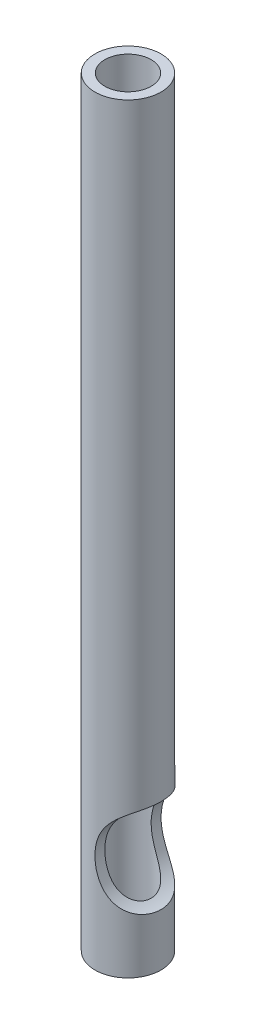
ISO-10303-21;
HEADER;
FILE_DESCRIPTION(('STEP AP214'),'2;1');
FILE_NAME('part.step','',(''),(''),'','','');
FILE_SCHEMA(('AUTOMOTIVE_DESIGN { 1 0 10303 214 1 1 1 1 }'));
ENDSEC;
DATA;
#1=APPLICATION_CONTEXT('core data for automotive mechanical design processes');
#2=APPLICATION_PROTOCOL_DEFINITION('international standard','automotive_design',2000,#1);
#3=PRODUCT_CONTEXT('',#1,'mechanical');
#4=PRODUCT('Part','Part','',(#3));
#5=PRODUCT_RELATED_PRODUCT_CATEGORY('part','',(#4));
#6=PRODUCT_DEFINITION_FORMATION('','',#4);
#7=PRODUCT_DEFINITION_CONTEXT('part definition',#1,'design');
#8=PRODUCT_DEFINITION('design','',#6,#7);
#9=PRODUCT_DEFINITION_SHAPE('','',#8);
#10=(LENGTH_UNIT() NAMED_UNIT(*) SI_UNIT(.MILLI.,.METRE.));
#11=(NAMED_UNIT(*) PLANE_ANGLE_UNIT() SI_UNIT($,.RADIAN.));
#12=(NAMED_UNIT(*) SI_UNIT($,.STERADIAN.) SOLID_ANGLE_UNIT());
#13=UNCERTAINTY_MEASURE_WITH_UNIT(LENGTH_MEASURE(1.E-05),#10,'distance_accuracy_value','');
#14=(GEOMETRIC_REPRESENTATION_CONTEXT(3) GLOBAL_UNCERTAINTY_ASSIGNED_CONTEXT((#13)) GLOBAL_UNIT_ASSIGNED_CONTEXT((#10,
#11,#12)) REPRESENTATION_CONTEXT('',''));
#15=CARTESIAN_POINT('',(0.,0.,0.));
#16=DIRECTION('',(0.,0.,1.));
#17=DIRECTION('',(1.,0.,0.));
#18=AXIS2_PLACEMENT_3D('',#15,#16,#17);
#19=CARTESIAN_POINT('',(0.,0.,0.));
#20=DIRECTION('',(0.,-1.,0.));
#21=DIRECTION('',(0.,0.,-1.));
#22=AXIS2_PLACEMENT_3D('',#19,#20,#21);
#23=CYLINDRICAL_SURFACE('',#22,0.7);
#24=CARTESIAN_POINT('',(0.,13.,0.));
#25=DIRECTION('',(0.,-1.,0.));
#26=DIRECTION('',(0.,0.,-1.));
#27=AXIS2_PLACEMENT_3D('',#24,#25,#26);
#28=CIRCLE('',#27,0.7);
#29=CARTESIAN_POINT('',(0.,13.,-0.7));
#30=VERTEX_POINT('',#29);
#31=EDGE_CURVE('E68',#30,#30,#28,.T.);
#32=ORIENTED_EDGE('',*,*,#31,.T.);
#33=EDGE_LOOP('',(#32));
#34=FACE_BOUND('',#33,.T.);
#35=CARTESIAN_POINT('',(0.,23.,0.));
#36=DIRECTION('',(0.,-1.,0.));
#37=DIRECTION('',(0.,0.,-1.));
#38=AXIS2_PLACEMENT_3D('',#35,#36,#37);
#39=CIRCLE('',#38,0.7);
#40=CARTESIAN_POINT('',(0.,23.,-0.7));
#41=VERTEX_POINT('',#40);
#42=EDGE_CURVE('E12',#41,#41,#39,.T.);
#43=ORIENTED_EDGE('',*,*,#42,.F.);
#44=EDGE_LOOP('',(#43));
#45=FACE_BOUND('',#44,.T.);
#46=ADVANCED_FACE('F42',(#34,#45),#23,.F.);
#47=CARTESIAN_POINT('',(0.,23.,-0.7));
#48=DIRECTION('',(0.,1.,0.));
#49=DIRECTION('',(0.,0.,1.));
#50=AXIS2_PLACEMENT_3D('',#47,#48,#49);
#51=PLANE('',#50);
#52=ORIENTED_EDGE('',*,*,#42,.T.);
#53=EDGE_LOOP('',(#52));
#54=FACE_BOUND('',#53,.T.);
#55=CARTESIAN_POINT('',(0.,23.,0.));
#56=DIRECTION('',(0.,-1.,0.));
#57=DIRECTION('',(0.,0.,-1.));
#58=AXIS2_PLACEMENT_3D('',#55,#56,#57);
#59=CIRCLE('',#58,1.);
#60=CARTESIAN_POINT('',(0.,23.,-1.));
#61=VERTEX_POINT('',#60);
#62=EDGE_CURVE('E53',#61,#61,#59,.T.);
#63=ORIENTED_EDGE('',*,*,#62,.F.);
#64=EDGE_LOOP('',(#63));
#65=FACE_BOUND('',#64,.T.);
#66=ADVANCED_FACE('F102',(#54,#65),#51,.T.);
#67=CARTESIAN_POINT('',(0.,0.,0.));
#68=DIRECTION('',(0.,-1.,0.));
#69=DIRECTION('',(0.,0.,-1.));
#70=AXIS2_PLACEMENT_3D('',#67,#68,#69);
#71=CYLINDRICAL_SURFACE('',#70,1.);
#72=CARTESIAN_POINT('',(0.,3.,-1.));
#73=CARTESIAN_POINT('',(2.77680019554288E-06,3.08489862037044,-1.00000373641876));
#74=CARTESIAN_POINT('',(0.00723040004783141,3.16981590641455,-1.00007893242621));
#75=CARTESIAN_POINT('',(0.0359405503504145,3.33729553192129,-0.999455078301943));
#76=CARTESIAN_POINT('',(0.0574415269876092,3.4198546790298,-0.998755025308173));
#77=CARTESIAN_POINT('',(0.113927912177793,3.579570104812,-0.993889594767322));
#78=CARTESIAN_POINT('',(0.148815433192106,3.65676090800029,-0.989749124485767));
#79=CARTESIAN_POINT('',(0.210108149985833,3.76677803028692,-0.977895187758473));
#80=CARTESIAN_POINT('',(0.232016796307576,3.80246919674611,-0.973007959573564));
#81=CARTESIAN_POINT('',(0.278506444099808,3.87159934021155,-0.960736082521314));
#82=CARTESIAN_POINT('',(0.303085943056434,3.90503956653292,-0.953352832929601));
#83=CARTESIAN_POINT('',(0.363226987475994,3.98019116518785,-0.932412605435518));
#84=CARTESIAN_POINT('',(0.39968575573749,4.02086096288403,-0.91761102090851));
#85=CARTESIAN_POINT('',(0.474969856575777,4.09642768983964,-0.880993318905002));
#86=CARTESIAN_POINT('',(0.513792786637597,4.13133035011223,-0.859184229295824));
#87=CARTESIAN_POINT('',(0.591783359826445,4.19485931804915,-0.807459525970014));
#88=CARTESIAN_POINT('',(0.630951584355168,4.22344257825955,-0.777491239483467));
#89=CARTESIAN_POINT('',(0.706572740761943,4.27379081660313,-0.709461578004986));
#90=CARTESIAN_POINT('',(0.743026081711479,4.29555682353277,-0.671401425618962));
#91=CARTESIAN_POINT('',(0.806986081415749,4.33076190973526,-0.592518285036785));
#92=CARTESIAN_POINT('',(0.835030905014543,4.34483729221757,-0.552410607338725));
#93=CARTESIAN_POINT('',(0.885348131023728,4.36856835252025,-0.467538397540627));
#94=CARTESIAN_POINT('',(0.907620170805514,4.37822375272004,-0.422773573140298));
#95=CARTESIAN_POINT('',(0.945298505686531,4.39381600640468,-0.330016165822398));
#96=CARTESIAN_POINT('',(0.960726080357253,4.39976440869178,-0.282034128511345));
#97=CARTESIAN_POINT('',(0.9842124413565,4.40858836092333,-0.184028256903969));
#98=CARTESIAN_POINT('',(0.992270248656877,4.41146350261261,-0.134004152253403));
#99=CARTESIAN_POINT('',(1.00087636907188,4.41453125916793,-0.0314339450685174));
#100=CARTESIAN_POINT('',(1.00114729200367,4.41462478937296,0.0211385625962523));
#101=CARTESIAN_POINT('',(0.993461667544822,4.41189053092997,0.125609856868634));
#102=CARTESIAN_POINT('',(0.985503835462053,4.40906228612779,0.177508536995686));
#103=CARTESIAN_POINT('',(0.961539196314003,4.40008022092056,0.279682545039473));
#104=CARTESIAN_POINT('',(0.945451673041939,4.39389300402845,0.329936103836291));
#105=CARTESIAN_POINT('',(0.905884573256844,4.37749141310711,0.426736946171191));
#106=CARTESIAN_POINT('',(0.882407079520328,4.36727817356077,0.473285269360962));
#107=CARTESIAN_POINT('',(0.82986932527628,4.34229164839992,0.56020928590894));
#108=CARTESIAN_POINT('',(0.800953082817854,4.32763105677295,0.60070424485194));
#109=CARTESIAN_POINT('',(0.738819875156725,4.29300569609329,0.675657474637512));
#110=CARTESIAN_POINT('',(0.705604704865368,4.27304313710701,0.710118250853974));
#111=CARTESIAN_POINT('',(0.637980342989685,4.22821483541021,0.771361149433174));
#112=CARTESIAN_POINT('',(0.603643231037072,4.20352617293452,0.798353467630104));
#113=CARTESIAN_POINT('',(0.534730013380154,4.14899286478887,0.846063254896131));
#114=CARTESIAN_POINT('',(0.500153868377687,4.11914735097739,0.866779665814344));
#115=CARTESIAN_POINT('',(0.430883355662674,4.0532701136745,0.903297494978913));
#116=CARTESIAN_POINT('',(0.396258787800148,4.01701467788175,0.91882439206268));
#117=CARTESIAN_POINT('',(0.330062310954782,3.94012207496826,0.944628764942277));
#118=CARTESIAN_POINT('',(0.29849301838792,3.89948121423609,0.954901773209555));
#119=CARTESIAN_POINT('',(0.226222770519927,3.79565610289729,0.97508930318659));
#120=CARTESIAN_POINT('',(0.1877276487948,3.73050083824715,0.98280101577086));
#121=CARTESIAN_POINT('',(0.120880456970943,3.59479526245944,0.993245807968715));
#122=CARTESIAN_POINT('',(0.0925443689741133,3.52423666060212,0.995971070337802));
#123=CARTESIAN_POINT('',(0.0465521193643577,3.37866530977072,0.999186141699077));
#124=CARTESIAN_POINT('',(0.0290400735195175,3.30360646947091,0.999646330666252));
#125=CARTESIAN_POINT('',(0.00571839047528356,3.15174244070633,1.00005160883549));
#126=CARTESIAN_POINT('',(-9.71217412221709E-05,3.07493814857511,0.999996956714));
#127=CARTESIAN_POINT('',(0.000108699389904601,2.91409597254872,1.00000332934179));
#128=CARTESIAN_POINT('',(0.00729403253382592,2.83005674613976,1.00007571014038));
#129=CARTESIAN_POINT('',(0.0356292681033505,2.66427791705439,0.999463632375408));
#130=CARTESIAN_POINT('',(0.0567972054297969,2.58254142661855,0.998778195600977));
#131=CARTESIAN_POINT('',(0.112639684650879,2.423520754529,0.994031665290598));
#132=CARTESIAN_POINT('',(0.147355159195726,2.34625088850266,0.989960298905315));
#133=CARTESIAN_POINT('',(0.20841024699555,2.23608508804038,0.978256583822911));
#134=CARTESIAN_POINT('',(0.230243942923065,2.20033837318318,0.973426906460443));
#135=CARTESIAN_POINT('',(0.276593765439936,2.13108684859386,0.961286389268312));
#136=CARTESIAN_POINT('',(0.301108390768511,2.09758080090751,0.953976933287217));
#137=CARTESIAN_POINT('',(0.361167141801434,2.0221965835411,0.933210356528138));
#138=CARTESIAN_POINT('',(0.397620472139578,1.98136286715741,0.918506574031003));
#139=CARTESIAN_POINT('',(0.472937096960165,1.90547009283718,0.882084865030788));
#140=CARTESIAN_POINT('',(0.511797912893913,1.87040522742285,0.860374058512351));
#141=CARTESIAN_POINT('',(0.589911100774644,1.8065598090036,0.808828527275448));
#142=CARTESIAN_POINT('',(0.62916435375717,1.77782282608445,0.77894047317767));
#143=CARTESIAN_POINT('',(0.704988588210151,1.72719148715812,0.711038026434558));
#144=CARTESIAN_POINT('',(0.741559998617225,1.70529603507475,0.67302493713967));
#145=CARTESIAN_POINT('',(0.805722968217053,1.66989378952788,0.594234633877867));
#146=CARTESIAN_POINT('',(0.833856108430539,1.65574185696182,0.554183217525299));
#147=CARTESIAN_POINT('',(0.884362232843472,1.63187251710613,0.469401528307084));
#148=CARTESIAN_POINT('',(0.906734859603383,1.62215538496673,0.424670965342711));
#149=CARTESIAN_POINT('',(0.944604395803005,1.60645895416376,0.331994736327199));
#150=CARTESIAN_POINT('',(0.960127556215577,1.6004653481749,0.2840621704404));
#151=CARTESIAN_POINT('',(0.983814848792878,1.59155631187449,0.186137708707621));
#152=CARTESIAN_POINT('',(0.991978012453049,1.58864128666583,0.136145542742981));
#153=CARTESIAN_POINT('',(1.00080480229625,1.58549359429988,0.0336186078696473));
#154=CARTESIAN_POINT('',(1.00119077678439,1.58536022880844,-0.0189432789735351));
#155=CARTESIAN_POINT('',(0.993736389306556,1.58801128504949,-0.123414025453887));
#156=CARTESIAN_POINT('',(0.985894731355808,1.59079616645282,-0.175322780908775));
#157=CARTESIAN_POINT('',(0.962157109998854,1.59968339868604,-0.277550588635241));
#158=CARTESIAN_POINT('',(0.946178531978116,1.60581982523804,-0.327847595625111));
#159=CARTESIAN_POINT('',(0.906815707355421,1.62210914547017,-0.424756118448324));
#160=CARTESIAN_POINT('',(0.883433517956193,1.63226092362059,-0.471368653575875));
#161=CARTESIAN_POINT('',(0.83105768863006,1.65711778138524,-0.55844752404192));
#162=CARTESIAN_POINT('',(0.802207232845021,1.67171145026869,-0.599031608084025));
#163=CARTESIAN_POINT('',(0.74017744059787,1.70619824530583,-0.674172821790559));
#164=CARTESIAN_POINT('',(0.70699992461262,1.72608914645925,-0.708732471841565));
#165=CARTESIAN_POINT('',(0.639426387150341,1.77077361881328,-0.770165162480344));
#166=CARTESIAN_POINT('',(0.605103841482386,1.7953889950476,-0.797249618695939));
#167=CARTESIAN_POINT('',(0.536193588897578,1.84978091392144,-0.845138939567165));
#168=CARTESIAN_POINT('',(0.501605839163186,1.87955830749069,-0.865942767343759));
#169=CARTESIAN_POINT('',(0.432319177251974,1.94527765392733,-0.902612411267133));
#170=CARTESIAN_POINT('',(0.397687761926934,1.98143952119812,-0.918208348201147));
#171=CARTESIAN_POINT('',(0.331455768654363,2.05814957531349,-0.94414224142858));
#172=CARTESIAN_POINT('',(0.29985777806795,2.09870144498382,-0.954475740897021));
#173=CARTESIAN_POINT('',(0.227514545469142,2.20228934669094,-0.974791140601227));
#174=CARTESIAN_POINT('',(0.188961815414647,2.26729635256532,-0.982567346320433));
#175=CARTESIAN_POINT('',(0.121961909099795,2.40271535113778,-0.993116446735297));
#176=CARTESIAN_POINT('',(0.093530733404874,2.4731356896777,-0.995881447489761));
#177=CARTESIAN_POINT('',(0.047234424989408,2.61869167361449,-0.99915874676463));
#178=CARTESIAN_POINT('',(0.029551133369506,2.69388589992339,-0.999633171622463));
#179=CARTESIAN_POINT('',(0.00593541932425141,2.84604886833765,-1.00005197979742));
#180=CARTESIAN_POINT('',(-2.51790987472826E-06,2.9230167604696,-0.999996611939996));
#181=CARTESIAN_POINT('',(0.,3.,-1.));
#182=B_SPLINE_CURVE_WITH_KNOTS('',3,(#72,#73,#74,#75,#76,#77,#78,#79,#80,#81,#82,#83,#84,#85,
#86,#87,#88,#89,#90,#91,#92,#93,#94,#95,#96,#97,#98,#99,#100,#101,#102,#103,#104,#105,#106,#107,
#108,#109,#110,#111,#112,#113,#114,#115,#116,#117,#118,#119,#120,#121,#122,#123,#124,#125,#126,
#127,#128,#129,#130,#131,#132,#133,#134,#135,#136,#137,#138,#139,#140,#141,#142,#143,#144,#145,
#146,#147,#148,#149,#150,#151,#152,#153,#154,#155,#156,#157,#158,#159,#160,#161,#162,#163,#164,
#165,#166,#167,#168,#169,#170,#171,#172,#173,#174,#175,#176,#177,#178,#179,#180,#181),
.UNSPECIFIED.,.T.,.F.,(4,2,2,2,2,2,2,2,2,2,2,2,2,2,2,2,2,2,2,2,2,2,2,2,2,2,2,2,2,2,2,2,2,2,2,2,
2,2,2,2,2,2,2,2,2,2,2,2,2,2,2,2,2,2,4),(0.,0.254418180718445,0.509165861623538,
0.762085176498697,0.888393310482604,1.0146307529187,1.18368467154967,1.35256957147399,
1.52257169772031,1.69254815645219,1.84458875557754,1.99663890311442,2.14821295312757,
2.29980713589516,2.45679507172163,2.61380752056606,2.7724104397935,2.93096869861174,
3.08580421588365,3.24057529270417,3.39040028930212,3.54025053313903,3.69709464384279,
3.8540719026531,4.08105208981243,4.3083878093128,4.53868860802636,4.76887370071841,
5.02069530997607,5.27284235710662,5.52575721666711,5.65207092143224,5.77831425205647,
5.94763470791129,6.11678365252389,6.28706316836221,6.45731538985144,6.60943160585086,
6.76155725837953,6.91309470620952,7.06465209199636,7.22161096895378,7.37859457317715,
7.53720479910578,7.69577099146022,7.85064866452116,8.00546138652486,8.15529651785212,
8.30515637219178,8.46188154513476,8.61873923079151,8.84544689436695,9.07251137164867,
9.30331769540202,9.53401562266723),.UNSPECIFIED.);
#183=CARTESIAN_POINT('',(0.,3.,-1.));
#184=VERTEX_POINT('',#183);
#185=EDGE_CURVE('E71',#184,#184,#182,.T.);
#186=ORIENTED_EDGE('',*,*,#185,.F.);
#187=EDGE_LOOP('',(#186));
#188=FACE_BOUND('',#187,.T.);
#189=ORIENTED_EDGE('',*,*,#62,.T.);
#190=EDGE_LOOP('',(#189));
#191=FACE_BOUND('',#190,.T.);
#192=CARTESIAN_POINT('',(0.,0.,0.));
#193=DIRECTION('',(0.,-1.,0.));
#194=DIRECTION('',(0.,0.,-1.));
#195=AXIS2_PLACEMENT_3D('',#192,#193,#194);
#196=CIRCLE('',#195,1.);
#197=CARTESIAN_POINT('',(0.,0.,-1.));
#198=VERTEX_POINT('',#197);
#199=EDGE_CURVE('E57',#198,#198,#196,.T.);
#200=ORIENTED_EDGE('',*,*,#199,.F.);
#201=EDGE_LOOP('',(#200));
#202=FACE_BOUND('',#201,.T.);
#203=ADVANCED_FACE('F76',(#188,#191,#202),#71,.T.);
#204=CARTESIAN_POINT('',(0.,0.,-1.));
#205=DIRECTION('',(0.,-1.,0.));
#206=DIRECTION('',(0.,0.,-1.));
#207=AXIS2_PLACEMENT_3D('',#204,#205,#206);
#208=PLANE('',#207);
#209=ORIENTED_EDGE('',*,*,#199,.T.);
#210=EDGE_LOOP('',(#209));
#211=FACE_BOUND('',#210,.T.);
#212=CARTESIAN_POINT('',(0.,0.,0.));
#213=DIRECTION('',(0.,-1.,0.));
#214=DIRECTION('',(0.,0.,-1.));
#215=AXIS2_PLACEMENT_3D('',#212,#213,#214);
#216=CIRCLE('',#215,0.7);
#217=CARTESIAN_POINT('',(0.,0.,-0.7));
#218=VERTEX_POINT('',#217);
#219=EDGE_CURVE('E62',#218,#218,#216,.T.);
#220=ORIENTED_EDGE('',*,*,#219,.F.);
#221=EDGE_LOOP('',(#220));
#222=FACE_BOUND('',#221,.T.);
#223=ADVANCED_FACE('F95',(#211,#222),#208,.T.);
#224=CARTESIAN_POINT('',(0.,0.,0.));
#225=DIRECTION('',(0.,-1.,0.));
#226=DIRECTION('',(0.,0.,-1.));
#227=AXIS2_PLACEMENT_3D('',#224,#225,#226);
#228=CYLINDRICAL_SURFACE('',#227,0.7);
#229=CARTESIAN_POINT('',(0.,3.,-0.7));
#230=CARTESIAN_POINT('',(-1.59489350531432E-06,2.95791810753929,-0.699994096384624));
#231=CARTESIAN_POINT('',(0.00177073047111459,2.91585338464862,-0.700005192341051));
#232=CARTESIAN_POINT('',(0.00884378020384458,2.83200697994239,-0.69995456878732));
#233=CARTESIAN_POINT('',(0.0141450026723619,2.7902253389247,-0.699892838996929));
#234=CARTESIAN_POINT('',(0.0282453478586609,2.70723594418299,-0.699465250535906));
#235=CARTESIAN_POINT('',(0.0370462341586859,2.66602849066186,-0.699099238426997));
#236=CARTESIAN_POINT('',(0.058073458930816,2.5845247786324,-0.697665682601964));
#237=CARTESIAN_POINT('',(0.0702989961249556,2.54422830935837,-0.696598302908831));
#238=CARTESIAN_POINT('',(0.106131572985085,2.44184649061173,-0.692265757624131));
#239=CARTESIAN_POINT('',(0.132231113132332,2.38064443292488,-0.688086289544436));
#240=CARTESIAN_POINT('',(0.191985485437709,2.26282200617402,-0.673854829932849));
#241=CARTESIAN_POINT('',(0.225623009076487,2.20619153885551,-0.663816208621347));
#242=CARTESIAN_POINT('',(0.287770455012766,2.11537110065127,-0.6387078489774));
#243=CARTESIAN_POINT('',(0.314816293790928,2.07952663907626,-0.626032514585019));
#244=CARTESIAN_POINT('',(0.370559463536321,2.01193605509735,-0.594729575781556));
#245=CARTESIAN_POINT('',(0.399254363151152,1.98018411206234,-0.576110558954187));
#246=CARTESIAN_POINT('',(0.45140270469839,1.92688143612261,-0.535835414766771));
#247=CARTESIAN_POINT('',(0.474885951380007,1.90451962509042,-0.515298114648122));
#248=CARTESIAN_POINT('',(0.520382926057785,1.86365306748534,-0.469303259743368));
#249=CARTESIAN_POINT('',(0.542397133637226,1.84514705791682,-0.443847321375271));
#250=CARTESIAN_POINT('',(0.583585269056737,1.81219246699774,-0.388116411701044));
#251=CARTESIAN_POINT('',(0.602742918151847,1.79776674925032,-0.357815718601909));
#252=CARTESIAN_POINT('',(0.636652764532916,1.77318561092152,-0.293259040811204));
#253=CARTESIAN_POINT('',(0.651405775093621,1.76302940187434,-0.259003787913315));
#254=CARTESIAN_POINT('',(0.674223196798256,1.74769689464129,-0.191241984447738));
#255=CARTESIAN_POINT('',(0.682805363922242,1.74212698530402,-0.157997334721393));
#256=CARTESIAN_POINT('',(0.695011969021843,1.73427966495327,-0.0902352126014067));
#257=CARTESIAN_POINT('',(0.698637621719948,1.73200144721753,-0.0557180541994105));
#258=CARTESIAN_POINT('',(0.700689919390576,1.73070713989762,0.012314726671559));
#259=CARTESIAN_POINT('',(0.699294215937936,1.73157958650699,0.0458230828162925));
#260=CARTESIAN_POINT('',(0.69177247063001,1.73635927779852,0.112080285213514));
#261=CARTESIAN_POINT('',(0.685647039851957,1.74026613043807,0.144829229018546));
#262=CARTESIAN_POINT('',(0.669018007513135,1.75117394405879,0.208558118185631));
#263=CARTESIAN_POINT('',(0.658526186929043,1.75816658230886,0.239542570505946));
#264=CARTESIAN_POINT('',(0.633745787237825,1.77532475266653,0.299004683489511));
#265=CARTESIAN_POINT('',(0.619457452327745,1.78549008070967,0.327482505225919));
#266=CARTESIAN_POINT('',(0.587595855465805,1.80923608458603,0.381758384600587));
#267=CARTESIAN_POINT('',(0.569967533384232,1.82287556065461,0.407498227691515));
#268=CARTESIAN_POINT('',(0.532604899356421,1.8533842147925,0.455249726369774));
#269=CARTESIAN_POINT('',(0.512870188354306,1.87025400532803,0.477260673466078));
#270=CARTESIAN_POINT('',(0.470876083288955,1.9083220461479,0.518855543467872));
#271=CARTESIAN_POINT('',(0.448537073114128,1.92974360267297,0.53815322253022));
#272=CARTESIAN_POINT('',(0.403768684058939,1.97564200693633,0.57251094777901));
#273=CARTESIAN_POINT('',(0.381339265021353,2.00012040189859,0.587568835335842));
#274=CARTESIAN_POINT('',(0.325875417579776,2.06508409039725,0.620746632021905));
#275=CARTESIAN_POINT('',(0.293374653728729,2.10728636537476,0.636403635893828));
#276=CARTESIAN_POINT('',(0.23234187046697,2.19626987865124,0.661141030391323));
#277=CARTESIAN_POINT('',(0.203821170432975,2.24306355704285,0.670202960682279));
#278=CARTESIAN_POINT('',(0.141860540449446,2.35870965625083,0.686490118274828));
#279=CARTESIAN_POINT('',(0.110770878212891,2.42910499313023,0.691656383029107));
#280=CARTESIAN_POINT('',(0.0597179136979805,2.57396655112615,0.697923976344156));
#281=CARTESIAN_POINT('',(0.0397617269085981,2.64843534231611,0.699022707835269));
#282=CARTESIAN_POINT('',(0.0183945128729103,2.7625329553179,0.699790695892009));
#283=CARTESIAN_POINT('',(0.0126866024455025,2.80140103256183,0.699896146477154));
#284=CARTESIAN_POINT('',(0.00433642576639479,2.87946202700036,0.700000355260322));
#285=CARTESIAN_POINT('',(0.00169326181503497,2.91865484568506,0.699999144708626));
#286=CARTESIAN_POINT('',(-0.000511471843425646,2.99714691069481,0.700000356677572));
#287=CARTESIAN_POINT('',(-7.13233736039557E-05,3.03644620415901,0.700002781223281));
#288=CARTESIAN_POINT('',(0.00389021015382038,3.11487708209524,0.699992010263722));
#289=CARTESIAN_POINT('',(0.00741066187864827,3.15400871376002,0.699978819489473));
#290=CARTESIAN_POINT('',(0.017891079782043,3.23480869106748,0.699792591672339));
#291=CARTESIAN_POINT('',(0.0250900225561178,3.27644623779504,0.69960759612168));
#292=CARTESIAN_POINT('',(0.0429692444367817,3.35894619074992,0.698737116937022));
#293=CARTESIAN_POINT('',(0.0536482544735883,3.39980887380585,0.69805181563579));
#294=CARTESIAN_POINT('',(0.0784017836166784,3.48045416458395,0.695706695498633));
#295=CARTESIAN_POINT('',(0.0924750996498616,3.52023714944698,0.694047221648901));
#296=CARTESIAN_POINT('',(0.123874899945913,3.59837479174325,0.689134862795172));
#297=CARTESIAN_POINT('',(0.141199717444183,3.63673016896974,0.685882792809466));
#298=CARTESIAN_POINT('',(0.184724394615585,3.72322683094623,0.675664384081681));
#299=CARTESIAN_POINT('',(0.212013291239893,3.77073615229976,0.667861632792456));
#300=CARTESIAN_POINT('',(0.270881605817912,3.86149605165039,0.64622076086679));
#301=CARTESIAN_POINT('',(0.302451328556354,3.90475588272521,0.632396126415498));
#302=CARTESIAN_POINT('',(0.360559764611318,3.9763667856036,0.600686039495149));
#303=CARTESIAN_POINT('',(0.386587397801829,4.005859386189,0.584463892768283));
#304=CARTESIAN_POINT('',(0.438810456089833,4.06080592512231,0.546340418355376));
#305=CARTESIAN_POINT('',(0.465005816562354,4.08626133179012,0.524441163092769));
#306=CARTESIAN_POINT('',(0.516024821084364,4.1326940203331,0.47434757742027));
#307=CARTESIAN_POINT('',(0.540833556249712,4.1536277570737,0.446096957435372));
#308=CARTESIAN_POINT('',(0.586707563766039,4.19027875453055,0.38375304733006));
#309=CARTESIAN_POINT('',(0.607775682171901,4.20599998915714,0.34966423834133));
#310=CARTESIAN_POINT('',(0.641509833524085,4.2301874319149,0.28225498420879));
#311=CARTESIAN_POINT('',(0.654962542310568,4.23938864915726,0.249588085252926));
#312=CARTESIAN_POINT('',(0.676905310826048,4.25406982086505,0.181837485582775));
#313=CARTESIAN_POINT('',(0.685396980817811,4.25955098288612,0.146754573200132));
#314=CARTESIAN_POINT('',(0.69646214634177,4.26663594637477,0.077904749643653));
#315=CARTESIAN_POINT('',(0.699416287237403,4.26848955483727,0.0442238124948493));
#316=CARTESIAN_POINT('',(0.700426400872624,4.26912676337632,-0.0232369387589483));
#317=CARTESIAN_POINT('',(0.69848339655424,4.26791100459872,-0.0570167307423435));
#318=CARTESIAN_POINT('',(0.689859320181322,4.26241720006523,-0.123273790685525));
#319=CARTESIAN_POINT('',(0.683238033897846,4.25817778847521,-0.155762086533673));
#320=CARTESIAN_POINT('',(0.665679311569086,4.24660285481631,-0.218967142556404));
#321=CARTESIAN_POINT('',(0.65474224712892,4.23926759930774,-0.249684054992999));
#322=CARTESIAN_POINT('',(0.629063845681827,4.22135802503744,-0.308744067551177));
#323=CARTESIAN_POINT('',(0.614296031333202,4.21076106293718,-0.337068751038533));
#324=CARTESIAN_POINT('',(0.581833656661179,4.18633132231985,-0.39044329011275));
#325=CARTESIAN_POINT('',(0.564138981250453,4.17249841655313,-0.415493016855414));
#326=CARTESIAN_POINT('',(0.526014355103572,4.14104573484474,-0.462896013156336));
#327=CARTESIAN_POINT('',(0.505500853263698,4.12329155741044,-0.485092292908454));
#328=CARTESIAN_POINT('',(0.463474430819167,4.08463475631943,-0.525396153998682));
#329=CARTESIAN_POINT('',(0.441961088094043,4.06373079435692,-0.543501989143424));
#330=CARTESIAN_POINT('',(0.390314581340032,4.01018290803988,-0.582301483123182));
#331=CARTESIAN_POINT('',(0.360177787323116,3.97618888824989,-0.601130342205023));
#332=CARTESIAN_POINT('',(0.301946229826639,3.90379407980304,-0.632397853217589));
#333=CARTESIAN_POINT('',(0.273856115102654,3.86538374037668,-0.644822324527368));
#334=CARTESIAN_POINT('',(0.21043282809247,3.76910666688471,-0.668797117984725));
#335=CARTESIAN_POINT('',(0.176703713306656,3.70960811192609,-0.678004993941166));
#336=CARTESIAN_POINT('',(0.117528295099117,3.58608462661937,-0.690727094499219));
#337=CARTESIAN_POINT('',(0.0920955812188001,3.52205247690621,-0.694232014704884));
#338=CARTESIAN_POINT('',(0.0476429963307884,3.38292052079175,-0.698779347433201));
#339=CARTESIAN_POINT('',(0.0298061943661479,3.30743168480774,-0.699463349652188));
#340=CARTESIAN_POINT('',(0.0059875984402385,3.15460896557145,-0.700079005114447));
#341=CARTESIAN_POINT('',(2.92872399215038E-06,3.07727553449438,-0.700010840886826));
#342=CARTESIAN_POINT('',(0.,3.,-0.7));
#343=B_SPLINE_CURVE_WITH_KNOTS('',3,(#229,#230,#231,#232,#233,#234,#235,#236,#237,#238,#239,
#240,#241,#242,#243,#244,#245,#246,#247,#248,#249,#250,#251,#252,#253,#254,#255,#256,#257,#258,
#259,#260,#261,#262,#263,#264,#265,#266,#267,#268,#269,#270,#271,#272,#273,#274,#275,#276,#277,
#278,#279,#280,#281,#282,#283,#284,#285,#286,#287,#288,#289,#290,#291,#292,#293,#294,#295,#296,
#297,#298,#299,#300,#301,#302,#303,#304,#305,#306,#307,#308,#309,#310,#311,#312,#313,#314,#315,
#316,#317,#318,#319,#320,#321,#322,#323,#324,#325,#326,#327,#328,#329,#330,#331,#332,#333,#334,
#335,#336,#337,#338,#339,#340,#341,#342),.UNSPECIFIED.,.T.,.F.,(4,2,2,2,2,2,2,2,2,2,2,2,2,2,2,2,
2,2,2,2,2,2,2,2,2,2,2,2,2,2,2,2,2,2,2,2,2,2,2,2,2,2,2,2,2,2,2,2,2,2,2,2,2,2,2,2,4),(0.,
0.126178514595874,0.252374842944307,0.378634846042519,0.50486533227008,0.704132615684078,
0.902946951668306,1.04244854528219,1.18174948881112,1.29642393099227,1.41106075147289,
1.52632775003398,1.64157345245569,1.74540435704872,1.84920981061941,1.94937939209188,
2.04953603389438,2.14942417679608,2.24930589630912,2.35100572776431,2.45272486059012,
2.56172030761632,2.67077114819286,2.8363854082495,3.00246147631175,3.23263921797312,
3.4629638999521,3.5807178138778,3.69843722760114,3.8162222457251,3.93397158730871,
4.06058512455468,4.18715254144405,4.31367516370911,4.44013310500442,4.60560831648434,
4.77071483148713,4.89787863417927,5.02499608104679,5.15328793745295,5.28148176052959,
5.39042209567459,5.499327051099,5.6004242858773,5.70150040467179,5.80130765936292,
5.90110632213964,6.00161405713226,6.10212574513715,6.20684951627685,6.31161790942487,
6.45832003024194,6.60534559904383,6.81124758979479,7.01748517488353,7.24924468656959,
7.48094795814195),.UNSPECIFIED.);
#344=CARTESIAN_POINT('',(0.,3.,-0.7));
#345=VERTEX_POINT('',#344);
#346=EDGE_CURVE('E45',#345,#345,#343,.T.);
#347=ORIENTED_EDGE('',*,*,#346,.F.);
#348=EDGE_LOOP('',(#347));
#349=FACE_BOUND('',#348,.T.);
#350=ORIENTED_EDGE('',*,*,#219,.T.);
#351=EDGE_LOOP('',(#350));
#352=FACE_BOUND('',#351,.T.);
#353=CARTESIAN_POINT('',(0.,7.,0.));
#354=DIRECTION('',(0.,-1.,0.));
#355=DIRECTION('',(0.,0.,-1.));
#356=AXIS2_PLACEMENT_3D('',#353,#354,#355);
#357=CIRCLE('',#356,0.7);
#358=CARTESIAN_POINT('',(0.,7.,-0.7));
#359=VERTEX_POINT('',#358);
#360=EDGE_CURVE('E65',#359,#359,#357,.T.);
#361=ORIENTED_EDGE('',*,*,#360,.F.);
#362=EDGE_LOOP('',(#361));
#363=FACE_BOUND('',#362,.T.);
#364=ADVANCED_FACE('F91',(#349,#352,#363),#228,.F.);
#365=CARTESIAN_POINT('',(0.,7.,0.));
#366=DIRECTION('',(0.,-1.,0.));
#367=DIRECTION('',(0.,0.,-1.));
#368=AXIS2_PLACEMENT_3D('',#365,#366,#367);
#369=PLANE('',#368);
#370=ORIENTED_EDGE('',*,*,#360,.T.);
#371=EDGE_LOOP('',(#370));
#372=FACE_BOUND('',#371,.T.);
#373=ADVANCED_FACE('F88',(#372),#369,.T.);
#374=CARTESIAN_POINT('',(0.,13.,-0.7));
#375=DIRECTION('',(0.,1.,0.));
#376=DIRECTION('',(0.,0.,1.));
#377=AXIS2_PLACEMENT_3D('',#374,#375,#376);
#378=PLANE('',#377);
#379=ORIENTED_EDGE('',*,*,#31,.F.);
#380=EDGE_LOOP('',(#379));
#381=FACE_BOUND('',#380,.T.);
#382=ADVANCED_FACE('F83',(#381),#378,.T.);
#383=CARTESIAN_POINT('',(1.5,3.,-5.));
#384=DIRECTION('',(0.,0.,1.));
#385=DIRECTION('',(1.,0.,0.));
#386=AXIS2_PLACEMENT_3D('',#383,#384,#385);
#387=CYLINDRICAL_SURFACE('',#386,1.5);
#388=ORIENTED_EDGE('',*,*,#185,.T.);
#389=EDGE_LOOP('',(#388));
#390=FACE_BOUND('',#389,.T.);
#391=ORIENTED_EDGE('',*,*,#346,.T.);
#392=EDGE_LOOP('',(#391));
#393=FACE_BOUND('',#392,.T.);
#394=ADVANCED_FACE('F79',(#390,#393),#387,.F.);
#395=CLOSED_SHELL('',(#46,#66,#203,#223,#364,#373,#382,#394));
#396=MANIFOLD_SOLID_BREP('B2',#395);
#397=ADVANCED_BREP_SHAPE_REPRESENTATION('',(#18,#396),#14);
#398=SHAPE_DEFINITION_REPRESENTATION(#9,#397);
ENDSEC;
END-ISO-10303-21;
